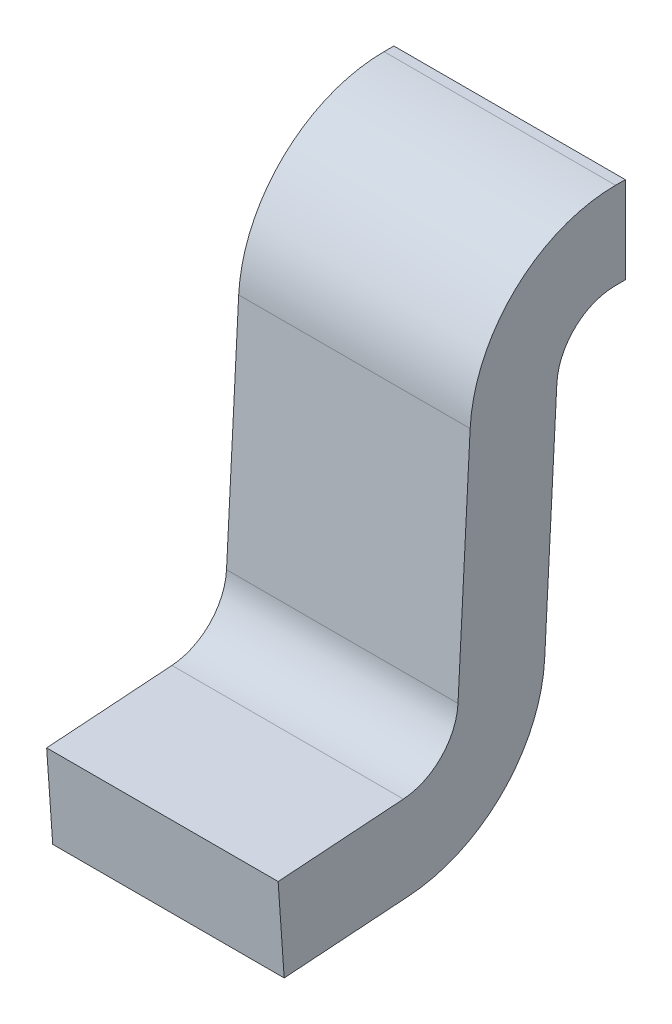
ISO-10303-21;
HEADER;
FILE_DESCRIPTION(('STEP AP214'),'2;1');
FILE_NAME('part.step','',(''),(''),'','','');
FILE_SCHEMA(('AUTOMOTIVE_DESIGN { 1 0 10303 214 1 1 1 1 }'));
ENDSEC;
DATA;
#1=APPLICATION_CONTEXT('core data for automotive mechanical design processes');
#2=APPLICATION_PROTOCOL_DEFINITION('international standard','automotive_design',2000,#1);
#3=PRODUCT_CONTEXT('',#1,'mechanical');
#4=PRODUCT('Part','Part','',(#3));
#5=PRODUCT_RELATED_PRODUCT_CATEGORY('part','',(#4));
#6=PRODUCT_DEFINITION_FORMATION('','',#4);
#7=PRODUCT_DEFINITION_CONTEXT('part definition',#1,'design');
#8=PRODUCT_DEFINITION('design','',#6,#7);
#9=PRODUCT_DEFINITION_SHAPE('','',#8);
#10=(LENGTH_UNIT() NAMED_UNIT(*) SI_UNIT(.MILLI.,.METRE.));
#11=(NAMED_UNIT(*) PLANE_ANGLE_UNIT() SI_UNIT($,.RADIAN.));
#12=(NAMED_UNIT(*) SI_UNIT($,.STERADIAN.) SOLID_ANGLE_UNIT());
#13=UNCERTAINTY_MEASURE_WITH_UNIT(LENGTH_MEASURE(1.E-05),#10,'distance_accuracy_value','');
#14=(GEOMETRIC_REPRESENTATION_CONTEXT(3) GLOBAL_UNCERTAINTY_ASSIGNED_CONTEXT((#13)) GLOBAL_UNIT_ASSIGNED_CONTEXT((#10,
#11,#12)) REPRESENTATION_CONTEXT('',''));
#15=CARTESIAN_POINT('',(0.,0.,0.));
#16=DIRECTION('',(0.,0.,1.));
#17=DIRECTION('',(1.,0.,0.));
#18=AXIS2_PLACEMENT_3D('',#15,#16,#17);
#19=CARTESIAN_POINT('',(-0.2,0.01612280193581,0.251100322008));
#20=DIRECTION('',(-1.,0.,0.));
#21=DIRECTION('',(0.,-0.0523359562429177,-0.998629534754575));
#22=AXIS2_PLACEMENT_3D('',#19,#20,#21);
#23=CYLINDRICAL_SURFACE('',#22,0.2516);
#24=CARTESIAN_POINT('',(0.2,0.01612280193581,0.251100322008));
#25=DIRECTION('',(-1.,0.,0.));
#26=DIRECTION('',(0.,-0.0523359562429177,-0.998629534754575));
#27=AXIS2_PLACEMENT_3D('',#24,#25,#26);
#28=CIRCLE('',#27,0.2516);
#29=CARTESIAN_POINT('',(0.2,0.002955075345083,-0.0001548689364499));
#30=VERTEX_POINT('',#29);
#31=CARTESIAN_POINT('',(0.2,-0.23486431311,0.233549593214));
#32=VERTEX_POINT('',#31);
#33=EDGE_CURVE('E126',#30,#32,#28,.T.);
#34=ORIENTED_EDGE('',*,*,#33,.T.);
#35=DIRECTION('',(1.,0.,0.));
#36=VECTOR('',#35,1.);
#37=CARTESIAN_POINT('',(-0.2,-0.23486431311,0.233549593214));
#38=LINE('',#37,#36);
#39=CARTESIAN_POINT('',(-0.2,-0.23486431311,0.233549593214));
#40=VERTEX_POINT('',#39);
#41=EDGE_CURVE('E11',#40,#32,#38,.T.);
#42=ORIENTED_EDGE('',*,*,#41,.F.);
#43=CARTESIAN_POINT('',(-0.2,0.01612280193581,0.251100322008));
#44=DIRECTION('',(-1.,0.,0.));
#45=DIRECTION('',(0.,-0.0523359562429177,-0.998629534754575));
#46=AXIS2_PLACEMENT_3D('',#43,#44,#45);
#47=CIRCLE('',#46,0.2516);
#48=CARTESIAN_POINT('',(-0.2,0.002955075345083,-0.0001548689364499));
#49=VERTEX_POINT('',#48);
#50=EDGE_CURVE('E257',#49,#40,#47,.T.);
#51=ORIENTED_EDGE('',*,*,#50,.F.);
#52=DIRECTION('',(1.,0.,0.));
#53=VECTOR('',#52,1.);
#54=CARTESIAN_POINT('',(-0.2,0.002955075345083,-0.0001548689364499));
#55=LINE('',#54,#53);
#56=EDGE_CURVE('E198',#49,#30,#55,.T.);
#57=ORIENTED_EDGE('',*,*,#56,.T.);
#58=EDGE_LOOP('',(#34,#42,#51,#57));
#59=FACE_BOUND('',#58,.T.);
#60=ADVANCED_FACE('F17',(#59),#23,.T.);
#61=CARTESIAN_POINT('',(-0.2,-0.25,0.45));
#62=DIRECTION('',(0.,-0.997564050259825,-0.0697564737441177));
#63=DIRECTION('',(0.,0.0697564737441177,-0.997564050259825));
#64=AXIS2_PLACEMENT_3D('',#61,#62,#63);
#65=PLANE('',#64);
#66=ORIENTED_EDGE('',*,*,#41,.T.);
#67=DIRECTION('',(0.,0.0697564737441177,-0.997564050259825));
#68=VECTOR('',#67,1.);
#69=CARTESIAN_POINT('',(0.2,-0.25,0.45));
#70=LINE('',#69,#68);
#71=CARTESIAN_POINT('',(0.2,-0.25,0.45));
#72=VERTEX_POINT('',#71);
#73=EDGE_CURVE('E172',#72,#32,#70,.T.);
#74=ORIENTED_EDGE('',*,*,#73,.F.);
#75=DIRECTION('',(1.,0.,0.));
#76=VECTOR('',#75,1.);
#77=CARTESIAN_POINT('',(-0.2,-0.25,0.45));
#78=LINE('',#77,#76);
#79=CARTESIAN_POINT('',(-0.2,-0.25,0.45));
#80=VERTEX_POINT('',#79);
#81=EDGE_CURVE('E25',#80,#72,#78,.T.);
#82=ORIENTED_EDGE('',*,*,#81,.F.);
#83=DIRECTION('',(0.,0.0697564737441177,-0.997564050259825));
#84=VECTOR('',#83,1.);
#85=CARTESIAN_POINT('',(-0.2,-0.25,0.45));
#86=LINE('',#85,#84);
#87=EDGE_CURVE('E250',#80,#40,#86,.T.);
#88=ORIENTED_EDGE('',*,*,#87,.T.);
#89=EDGE_LOOP('',(#66,#74,#82,#88));
#90=FACE_BOUND('',#89,.T.);
#91=ADVANCED_FACE('F173',(#90),#65,.T.);
#92=CARTESIAN_POINT('',(-0.2,-0.100365392461,0.460463471062));
#93=DIRECTION('',(0.,-0.0697564737441177,0.997564050259825));
#94=DIRECTION('',(-1.,0.,0.));
#95=AXIS2_PLACEMENT_3D('',#92,#93,#94);
#96=PLANE('',#95);
#97=ORIENTED_EDGE('',*,*,#81,.T.);
#98=DIRECTION('',(0.,-0.997564050259825,-0.0697564737441177));
#99=VECTOR('',#98,1.);
#100=CARTESIAN_POINT('',(0.2,-0.100365392461,0.460463471062));
#101=LINE('',#100,#99);
#102=CARTESIAN_POINT('',(0.2,-0.100365392461,0.460463471062));
#103=VERTEX_POINT('',#102);
#104=EDGE_CURVE('E163',#103,#72,#101,.T.);
#105=ORIENTED_EDGE('',*,*,#104,.F.);
#106=DIRECTION('',(1.,0.,0.));
#107=VECTOR('',#106,1.);
#108=CARTESIAN_POINT('',(-0.2,-0.100365392461,0.460463471062));
#109=LINE('',#108,#107);
#110=CARTESIAN_POINT('',(-0.2,-0.100365392461,0.460463471062));
#111=VERTEX_POINT('',#110);
#112=EDGE_CURVE('E138',#111,#103,#109,.T.);
#113=ORIENTED_EDGE('',*,*,#112,.F.);
#114=DIRECTION('',(0.,-0.997564050259825,-0.0697564737441177));
#115=VECTOR('',#114,1.);
#116=CARTESIAN_POINT('',(-0.2,-0.100365392461,0.460463471062));
#117=LINE('',#116,#115);
#118=EDGE_CURVE('E167',#111,#80,#117,.T.);
#119=ORIENTED_EDGE('',*,*,#118,.T.);
#120=EDGE_LOOP('',(#97,#105,#113,#119));
#121=FACE_BOUND('',#120,.T.);
#122=ADVANCED_FACE('F160',(#121),#96,.T.);
#123=CARTESIAN_POINT('',(-0.2,-0.07895942959831,0.154343940258));
#124=DIRECTION('',(0.,0.997564050259825,0.0697564737441177));
#125=DIRECTION('',(1.,0.,0.));
#126=AXIS2_PLACEMENT_3D('',#123,#124,#125);
#127=PLANE('',#126);
#128=ORIENTED_EDGE('',*,*,#112,.T.);
#129=DIRECTION('',(0.,-0.0697564737441177,0.997564050259825));
#130=VECTOR('',#129,1.);
#131=CARTESIAN_POINT('',(0.2,-0.08522970557059,0.244013064275));
#132=LINE('',#131,#130);
#133=CARTESIAN_POINT('',(0.2,-0.08522970557059,0.244013064275));
#134=VERTEX_POINT('',#133);
#135=EDGE_CURVE('E180',#134,#103,#132,.T.);
#136=ORIENTED_EDGE('',*,*,#135,.F.);
#137=DIRECTION('',(1.,0.,0.));
#138=VECTOR('',#137,1.);
#139=CARTESIAN_POINT('',(-0.2,-0.08522970557059,0.244013064275));
#140=LINE('',#139,#138);
#141=CARTESIAN_POINT('',(-0.2,-0.08522970557059,0.244013064275));
#142=VERTEX_POINT('',#141);
#143=EDGE_CURVE('E134',#142,#134,#140,.T.);
#144=ORIENTED_EDGE('',*,*,#143,.F.);
#145=DIRECTION('',(0.,-0.0697564737441177,0.997564050259825));
#146=VECTOR('',#145,1.);
#147=CARTESIAN_POINT('',(-0.2,-0.08522970557059,0.244013064275));
#148=LINE('',#147,#146);
#149=EDGE_CURVE('E243',#142,#111,#148,.T.);
#150=ORIENTED_EDGE('',*,*,#149,.T.);
#151=EDGE_LOOP('',(#128,#136,#144,#150));
#152=FACE_BOUND('',#151,.T.);
#153=ADVANCED_FACE('F309',(#152),#127,.T.);
#154=CARTESIAN_POINT('',(-0.2,0.01612280193581,0.251100322008));
#155=DIRECTION('',(1.,0.,0.));
#156=DIRECTION('',(0.,-0.997564050259826,-0.0697564737441078));
#157=AXIS2_PLACEMENT_3D('',#154,#155,#156);
#158=CYLINDRICAL_SURFACE('',#157,0.1016);
#159=CARTESIAN_POINT('',(0.2,0.01612280193581,0.251100322008));
#160=DIRECTION('',(1.,0.,0.));
#161=DIRECTION('',(0.,-0.997564050259825,-0.0697564737441177));
#162=AXIS2_PLACEMENT_3D('',#159,#160,#161);
#163=CIRCLE('',#162,0.1016);
#164=CARTESIAN_POINT('',(0.2,0.01080546878153,0.149639561277));
#165=VERTEX_POINT('',#164);
#166=EDGE_CURVE('E186',#134,#165,#163,.T.);
#167=ORIENTED_EDGE('',*,*,#166,.T.);
#168=DIRECTION('',(1.,0.,0.));
#169=VECTOR('',#168,1.);
#170=CARTESIAN_POINT('',(-0.2,0.01080546878153,0.149639561277));
#171=LINE('',#170,#169);
#172=CARTESIAN_POINT('',(-0.2,0.01080546878153,0.149639561277));
#173=VERTEX_POINT('',#172);
#174=EDGE_CURVE('E142',#173,#165,#171,.T.);
#175=ORIENTED_EDGE('',*,*,#174,.F.);
#176=CARTESIAN_POINT('',(-0.2,0.01612280193581,0.251100322008));
#177=DIRECTION('',(1.,0.,0.));
#178=DIRECTION('',(0.,-0.997564050259825,-0.0697564737441177));
#179=AXIS2_PLACEMENT_3D('',#176,#177,#178);
#180=CIRCLE('',#179,0.1016);
#181=EDGE_CURVE('E239',#142,#173,#180,.T.);
#182=ORIENTED_EDGE('',*,*,#181,.F.);
#183=ORIENTED_EDGE('',*,*,#143,.T.);
#184=EDGE_LOOP('',(#167,#175,#182,#183));
#185=FACE_BOUND('',#184,.T.);
#186=ADVANCED_FACE('F305',(#185),#158,.F.);
#187=CARTESIAN_POINT('',(-0.2,0.3984,-0.12261868962));
#188=DIRECTION('',(1.,0.,0.));
#189=DIRECTION('',(0.,1.,0.));
#190=AXIS2_PLACEMENT_3D('',#187,#188,#189);
#191=CYLINDRICAL_SURFACE('',#190,0.1016);
#192=CARTESIAN_POINT('',(0.2,0.3984,-0.12261868962));
#193=DIRECTION('',(1.,0.,0.));
#194=DIRECTION('',(0.,1.,0.));
#195=AXIS2_PLACEMENT_3D('',#192,#193,#194);
#196=CIRCLE('',#195,0.1016);
#197=CARTESIAN_POINT('',(0.2,0.5,-0.12261868962));
#198=VERTEX_POINT('',#197);
#199=CARTESIAN_POINT('',(0.2,0.403717333154,-0.02115792888869));
#200=VERTEX_POINT('',#199);
#201=EDGE_CURVE('E119',#198,#200,#196,.T.);
#202=ORIENTED_EDGE('',*,*,#201,.T.);
#203=DIRECTION('',(1.,0.,0.));
#204=VECTOR('',#203,1.);
#205=CARTESIAN_POINT('',(-0.2,0.403717333154,-0.02115792888869));
#206=LINE('',#205,#204);
#207=CARTESIAN_POINT('',(-0.2,0.403717333154,-0.02115792888869));
#208=VERTEX_POINT('',#207);
#209=EDGE_CURVE('E211',#208,#200,#206,.T.);
#210=ORIENTED_EDGE('',*,*,#209,.F.);
#211=CARTESIAN_POINT('',(-0.2,0.3984,-0.12261868962));
#212=DIRECTION('',(1.,0.,0.));
#213=DIRECTION('',(0.,1.,0.));
#214=AXIS2_PLACEMENT_3D('',#211,#212,#213);
#215=CIRCLE('',#214,0.1016);
#216=CARTESIAN_POINT('',(-0.2,0.5,-0.12261868962));
#217=VERTEX_POINT('',#216);
#218=EDGE_CURVE('E223',#217,#208,#215,.T.);
#219=ORIENTED_EDGE('',*,*,#218,.F.);
#220=DIRECTION('',(1.,0.,0.));
#221=VECTOR('',#220,1.);
#222=CARTESIAN_POINT('',(-0.2,0.5,-0.12261868962));
#223=LINE('',#222,#221);
#224=EDGE_CURVE('E103',#217,#198,#223,.T.);
#225=ORIENTED_EDGE('',*,*,#224,.T.);
#226=EDGE_LOOP('',(#202,#210,#219,#225));
#227=FACE_BOUND('',#226,.T.);
#228=ADVANCED_FACE('F300',(#227),#191,.F.);
#229=CARTESIAN_POINT('',(-0.2,0.5,-0.02620388964152));
#230=DIRECTION('',(0.,-1.,0.));
#231=DIRECTION('',(0.,0.,-1.));
#232=AXIS2_PLACEMENT_3D('',#229,#230,#231);
#233=PLANE('',#232);
#234=DIRECTION('',(1.,0.,0.));
#235=VECTOR('',#234,1.);
#236=CARTESIAN_POINT('',(-0.2,0.5,-0.139536528938));
#237=LINE('',#236,#235);
#238=CARTESIAN_POINT('',(-0.2,0.5,-0.139536528938));
#239=VERTEX_POINT('',#238);
#240=CARTESIAN_POINT('',(0.2,0.5,-0.139536528938));
#241=VERTEX_POINT('',#240);
#242=EDGE_CURVE('E91',#239,#241,#237,.T.);
#243=ORIENTED_EDGE('',*,*,#242,.T.);
#244=DIRECTION('',(0.,0.,-1.));
#245=VECTOR('',#244,1.);
#246=CARTESIAN_POINT('',(0.2,0.5,-0.12261868962));
#247=LINE('',#246,#245);
#248=EDGE_CURVE('E95',#198,#241,#247,.T.);
#249=ORIENTED_EDGE('',*,*,#248,.F.);
#250=ORIENTED_EDGE('',*,*,#224,.F.);
#251=DIRECTION('',(0.,0.,-1.));
#252=VECTOR('',#251,1.);
#253=CARTESIAN_POINT('',(-0.2,0.5,-0.12261868962));
#254=LINE('',#253,#252);
#255=EDGE_CURVE('E98',#217,#239,#254,.T.);
#256=ORIENTED_EDGE('',*,*,#255,.T.);
#257=EDGE_LOOP('',(#243,#249,#250,#256));
#258=FACE_BOUND('',#257,.T.);
#259=ADVANCED_FACE('F93',(#258),#233,.T.);
#260=CARTESIAN_POINT('',(-0.2,0.5,-0.139536528938));
#261=DIRECTION('',(0.,0.,-1.));
#262=DIRECTION('',(0.,-1.,0.));
#263=AXIS2_PLACEMENT_3D('',#260,#261,#262);
#264=PLANE('',#263);
#265=DIRECTION('',(1.,0.,0.));
#266=VECTOR('',#265,1.);
#267=CARTESIAN_POINT('',(-0.2,0.65,-0.139536528938));
#268=LINE('',#267,#266);
#269=CARTESIAN_POINT('',(-0.2,0.65,-0.139536528938));
#270=VERTEX_POINT('',#269);
#271=CARTESIAN_POINT('',(0.2,0.65,-0.139536528938));
#272=VERTEX_POINT('',#271);
#273=EDGE_CURVE('E104',#270,#272,#268,.T.);
#274=ORIENTED_EDGE('',*,*,#273,.T.);
#275=DIRECTION('',(0.,1.,0.));
#276=VECTOR('',#275,1.);
#277=CARTESIAN_POINT('',(0.2,0.5,-0.139536528938));
#278=LINE('',#277,#276);
#279=EDGE_CURVE('E107',#241,#272,#278,.T.);
#280=ORIENTED_EDGE('',*,*,#279,.F.);
#281=ORIENTED_EDGE('',*,*,#242,.F.);
#282=DIRECTION('',(0.,1.,0.));
#283=VECTOR('',#282,1.);
#284=CARTESIAN_POINT('',(-0.2,0.5,-0.139536528938));
#285=LINE('',#284,#283);
#286=EDGE_CURVE('E230',#239,#270,#285,.T.);
#287=ORIENTED_EDGE('',*,*,#286,.T.);
#288=EDGE_LOOP('',(#274,#280,#281,#287));
#289=FACE_BOUND('',#288,.T.);
#290=ADVANCED_FACE('F108',(#289),#264,.T.);
#291=CARTESIAN_POINT('',(-0.2,0.65,-0.139536528938));
#292=DIRECTION('',(0.,1.,0.));
#293=DIRECTION('',(1.,0.,0.));
#294=AXIS2_PLACEMENT_3D('',#291,#292,#293);
#295=PLANE('',#294);
#296=DIRECTION('',(1.,0.,0.));
#297=VECTOR('',#296,1.);
#298=CARTESIAN_POINT('',(-0.2,0.65,-0.12261868962));
#299=LINE('',#298,#297);
#300=CARTESIAN_POINT('',(-0.2,0.65,-0.12261868962));
#301=VERTEX_POINT('',#300);
#302=CARTESIAN_POINT('',(0.2,0.65,-0.12261868962));
#303=VERTEX_POINT('',#302);
#304=EDGE_CURVE('E50',#301,#303,#299,.T.);
#305=ORIENTED_EDGE('',*,*,#304,.T.);
#306=DIRECTION('',(0.,0.,1.));
#307=VECTOR('',#306,1.);
#308=CARTESIAN_POINT('',(0.2,0.65,-0.139536528938));
#309=LINE('',#308,#307);
#310=EDGE_CURVE('E113',#272,#303,#309,.T.);
#311=ORIENTED_EDGE('',*,*,#310,.F.);
#312=ORIENTED_EDGE('',*,*,#273,.F.);
#313=DIRECTION('',(0.,0.,1.));
#314=VECTOR('',#313,1.);
#315=CARTESIAN_POINT('',(-0.2,0.65,-0.139536528938));
#316=LINE('',#315,#314);
#317=EDGE_CURVE('E232',#270,#301,#316,.T.);
#318=ORIENTED_EDGE('',*,*,#317,.T.);
#319=EDGE_LOOP('',(#305,#311,#312,#318));
#320=FACE_BOUND('',#319,.T.);
#321=ADVANCED_FACE('F302',(#320),#295,.T.);
#322=CARTESIAN_POINT('',(-0.2,0.3984,-0.12261868962));
#323=DIRECTION('',(-1.,0.,0.));
#324=DIRECTION('',(0.,0.0523359562429177,0.998629534754575));
#325=AXIS2_PLACEMENT_3D('',#322,#323,#324);
#326=CYLINDRICAL_SURFACE('',#325,0.2516);
#327=CARTESIAN_POINT('',(0.2,0.3984,-0.12261868962));
#328=DIRECTION('',(-1.,0.,0.));
#329=DIRECTION('',(0.,0.0523359562429177,0.998629534754575));
#330=AXIS2_PLACEMENT_3D('',#327,#328,#329);
#331=CIRCLE('',#330,0.2516);
#332=CARTESIAN_POINT('',(0.2,0.411567726591,0.128636501324));
#333=VERTEX_POINT('',#332);
#334=EDGE_CURVE('E130',#333,#303,#331,.T.);
#335=ORIENTED_EDGE('',*,*,#334,.T.);
#336=ORIENTED_EDGE('',*,*,#304,.F.);
#337=CARTESIAN_POINT('',(-0.2,0.3984,-0.12261868962));
#338=DIRECTION('',(-1.,0.,0.));
#339=DIRECTION('',(0.,0.0523359562429177,0.998629534754575));
#340=AXIS2_PLACEMENT_3D('',#337,#338,#339);
#341=CIRCLE('',#340,0.2516);
#342=CARTESIAN_POINT('',(-0.2,0.411567726591,0.128636501324));
#343=VERTEX_POINT('',#342);
#344=EDGE_CURVE('E238',#343,#301,#341,.T.);
#345=ORIENTED_EDGE('',*,*,#344,.F.);
#346=DIRECTION('',(1.,0.,0.));
#347=VECTOR('',#346,1.);
#348=CARTESIAN_POINT('',(-0.2,0.411567726591,0.128636501324));
#349=LINE('',#348,#347);
#350=EDGE_CURVE('E37',#343,#333,#349,.T.);
#351=ORIENTED_EDGE('',*,*,#350,.T.);
#352=EDGE_LOOP('',(#335,#336,#345,#351));
#353=FACE_BOUND('',#352,.T.);
#354=ADVANCED_FACE('F276',(#353),#326,.T.);
#355=CARTESIAN_POINT('',(-0.2,0.007850393436442,0.149794430213));
#356=DIRECTION('',(0.,0.0523359562429177,0.998629534754575));
#357=DIRECTION('',(1.,0.,0.));
#358=AXIS2_PLACEMENT_3D('',#355,#356,#357);
#359=PLANE('',#358);
#360=ORIENTED_EDGE('',*,*,#174,.T.);
#361=DIRECTION('',(0.,-0.998629534754575,0.0523359562429177));
#362=VECTOR('',#361,1.);
#363=CARTESIAN_POINT('',(0.2,0.411567726591,0.128636501324));
#364=LINE('',#363,#362);
#365=EDGE_CURVE('E133',#333,#165,#364,.T.);
#366=ORIENTED_EDGE('',*,*,#365,.F.);
#367=ORIENTED_EDGE('',*,*,#350,.F.);
#368=DIRECTION('',(0.,0.998629534754575,-0.0523359562429177));
#369=VECTOR('',#368,1.);
#370=CARTESIAN_POINT('',(-0.2,0.01080546878153,0.149639561277));
#371=LINE('',#370,#369);
#372=EDGE_CURVE('E234',#173,#343,#371,.T.);
#373=ORIENTED_EDGE('',*,*,#372,.F.);
#374=EDGE_LOOP('',(#360,#366,#367,#373));
#375=FACE_BOUND('',#374,.T.);
#376=ADVANCED_FACE('F375',(#375),#359,.T.);
#377=CARTESIAN_POINT('',(0.2,0.,0.));
#378=DIRECTION('',(1.,0.,0.));
#379=DIRECTION('',(0.,1.,0.));
#380=AXIS2_PLACEMENT_3D('',#377,#378,#379);
#381=PLANE('',#380);
#382=ORIENTED_EDGE('',*,*,#166,.F.);
#383=ORIENTED_EDGE('',*,*,#135,.T.);
#384=ORIENTED_EDGE('',*,*,#104,.T.);
#385=ORIENTED_EDGE('',*,*,#73,.T.);
#386=ORIENTED_EDGE('',*,*,#33,.F.);
#387=DIRECTION('',(0.,0.998629534754575,-0.0523359562429177));
#388=VECTOR('',#387,1.);
#389=CARTESIAN_POINT('',(0.2,0.002955075345083,-0.0001548689364499));
#390=LINE('',#389,#388);
#391=EDGE_CURVE('E201',#30,#200,#390,.T.);
#392=ORIENTED_EDGE('',*,*,#391,.T.);
#393=ORIENTED_EDGE('',*,*,#201,.F.);
#394=ORIENTED_EDGE('',*,*,#248,.T.);
#395=ORIENTED_EDGE('',*,*,#279,.T.);
#396=ORIENTED_EDGE('',*,*,#310,.T.);
#397=ORIENTED_EDGE('',*,*,#334,.F.);
#398=ORIENTED_EDGE('',*,*,#365,.T.);
#399=EDGE_LOOP('',(#382,#383,#384,#385,#386,#392,#393,#394,#395,#396,#397,#398));
#400=FACE_BOUND('',#399,.T.);
#401=ADVANCED_FACE('F116',(#400),#381,.T.);
#402=CARTESIAN_POINT('',(-0.2,-0.219336739934,0.01149495145513));
#403=DIRECTION('',(0.,-0.0523359562429177,-0.998629534754575));
#404=DIRECTION('',(0.,-0.998629534754575,0.0523359562429177));
#405=AXIS2_PLACEMENT_3D('',#402,#403,#404);
#406=PLANE('',#405);
#407=ORIENTED_EDGE('',*,*,#56,.F.);
#408=DIRECTION('',(0.,-0.998629534754575,0.0523359562429177));
#409=VECTOR('',#408,1.);
#410=CARTESIAN_POINT('',(-0.2,0.403717333154,-0.02115792888869));
#411=LINE('',#410,#409);
#412=EDGE_CURVE('E227',#208,#49,#411,.T.);
#413=ORIENTED_EDGE('',*,*,#412,.F.);
#414=ORIENTED_EDGE('',*,*,#209,.T.);
#415=ORIENTED_EDGE('',*,*,#391,.F.);
#416=EDGE_LOOP('',(#407,#413,#414,#415));
#417=FACE_BOUND('',#416,.T.);
#418=ADVANCED_FACE('F206',(#417),#406,.T.);
#419=CARTESIAN_POINT('',(-0.2,0.,0.));
#420=DIRECTION('',(1.,0.,0.));
#421=DIRECTION('',(0.,1.,0.));
#422=AXIS2_PLACEMENT_3D('',#419,#420,#421);
#423=PLANE('',#422);
#424=ORIENTED_EDGE('',*,*,#50,.T.);
#425=ORIENTED_EDGE('',*,*,#87,.F.);
#426=ORIENTED_EDGE('',*,*,#118,.F.);
#427=ORIENTED_EDGE('',*,*,#149,.F.);
#428=ORIENTED_EDGE('',*,*,#181,.T.);
#429=ORIENTED_EDGE('',*,*,#372,.T.);
#430=ORIENTED_EDGE('',*,*,#344,.T.);
#431=ORIENTED_EDGE('',*,*,#317,.F.);
#432=ORIENTED_EDGE('',*,*,#286,.F.);
#433=ORIENTED_EDGE('',*,*,#255,.F.);
#434=ORIENTED_EDGE('',*,*,#218,.T.);
#435=ORIENTED_EDGE('',*,*,#412,.T.);
#436=EDGE_LOOP('',(#424,#425,#426,#427,#428,#429,#430,#431,#432,#433,#434,#435));
#437=FACE_BOUND('',#436,.T.);
#438=ADVANCED_FACE('F271',(#437),#423,.F.);
#439=CLOSED_SHELL('',(#60,#91,#122,#153,#186,#228,#259,#290,#321,#354,#376,#401,#418,#438));
#440=MANIFOLD_SOLID_BREP('B1',#439);
#441=ADVANCED_BREP_SHAPE_REPRESENTATION('',(#18,#440),#14);
#442=SHAPE_DEFINITION_REPRESENTATION(#9,#441);
ENDSEC;
END-ISO-10303-21;
